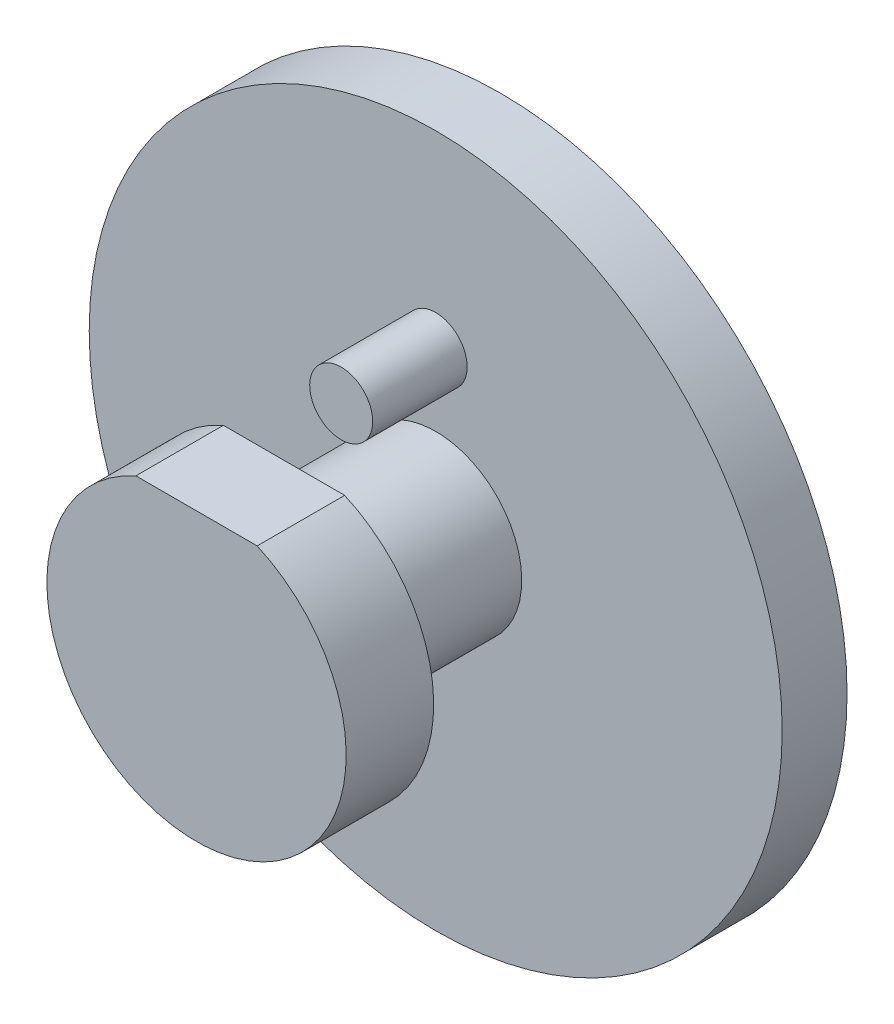
ISO-10303-21;
HEADER;
FILE_DESCRIPTION(('STEP AP214'),'2;1');
FILE_NAME('part.step','',(''),(''),'','','');
FILE_SCHEMA(('AUTOMOTIVE_DESIGN { 1 0 10303 214 1 1 1 1 }'));
ENDSEC;
DATA;
#1=APPLICATION_CONTEXT('core data for automotive mechanical design processes');
#2=APPLICATION_PROTOCOL_DEFINITION('international standard','automotive_design',2000,#1);
#3=PRODUCT_CONTEXT('',#1,'mechanical');
#4=PRODUCT('Part','Part','',(#3));
#5=PRODUCT_RELATED_PRODUCT_CATEGORY('part','',(#4));
#6=PRODUCT_DEFINITION_FORMATION('','',#4);
#7=PRODUCT_DEFINITION_CONTEXT('part definition',#1,'design');
#8=PRODUCT_DEFINITION('design','',#6,#7);
#9=PRODUCT_DEFINITION_SHAPE('','',#8);
#10=(LENGTH_UNIT() NAMED_UNIT(*) SI_UNIT(.MILLI.,.METRE.));
#11=(NAMED_UNIT(*) PLANE_ANGLE_UNIT() SI_UNIT($,.RADIAN.));
#12=(NAMED_UNIT(*) SI_UNIT($,.STERADIAN.) SOLID_ANGLE_UNIT());
#13=UNCERTAINTY_MEASURE_WITH_UNIT(LENGTH_MEASURE(1.E-05),#10,'distance_accuracy_value','');
#14=(GEOMETRIC_REPRESENTATION_CONTEXT(3) GLOBAL_UNCERTAINTY_ASSIGNED_CONTEXT((#13)) GLOBAL_UNIT_ASSIGNED_CONTEXT((#10,
#11,#12)) REPRESENTATION_CONTEXT('',''));
#15=CARTESIAN_POINT('',(0.,0.,0.));
#16=DIRECTION('',(0.,0.,1.));
#17=DIRECTION('',(1.,0.,0.));
#18=AXIS2_PLACEMENT_3D('',#15,#16,#17);
#19=CARTESIAN_POINT('',(39.944603412068,-18.266651036698,4.0692169679775));
#20=DIRECTION('',(0.,0.,1.));
#21=DIRECTION('',(1.,0.,0.));
#22=AXIS2_PLACEMENT_3D('',#19,#20,#21);
#23=PLANE('',#22);
#24=CARTESIAN_POINT('',(41.117637634,-17.094213762718,4.0692169679775));
#25=DIRECTION('',(0.,0.,1.));
#26=DIRECTION('',(1.,0.,0.));
#27=AXIS2_PLACEMENT_3D('',#24,#25,#26);
#28=CIRCLE('',#27,1.15912472548);
#29=CARTESIAN_POINT('',(40.6478001904893,-16.034580380058,4.0692169679775));
#30=VERTEX_POINT('',#29);
#31=CARTESIAN_POINT('',(41.5874750775107,-16.034580380058,4.0692169679775));
#32=VERTEX_POINT('',#31);
#33=EDGE_CURVE('E38',#30,#32,#28,.T.);
#34=ORIENTED_EDGE('',*,*,#33,.T.);
#35=DIRECTION('',(-1.,0.,0.));
#36=VECTOR('',#35,1.);
#37=CARTESIAN_POINT('',(41.117637634,-16.034580380058,4.0692169679775));
#38=LINE('',#37,#36);
#39=EDGE_CURVE('E62',#32,#30,#38,.T.);
#40=ORIENTED_EDGE('',*,*,#39,.T.);
#41=EDGE_LOOP('',(#34,#40));
#42=FACE_BOUND('',#41,.T.);
#43=ADVANCED_FACE('F34',(#42),#23,.T.);
#44=CARTESIAN_POINT('',(41.117637634,-17.094213762718,3.3914391903895));
#45=DIRECTION('',(0.,0.,1.));
#46=DIRECTION('',(1.,0.,0.));
#47=AXIS2_PLACEMENT_3D('',#44,#45,#46);
#48=CYLINDRICAL_SURFACE('',#47,1.15912472548);
#49=CARTESIAN_POINT('',(41.117637634,-17.094213762718,3.3914391903895));
#50=DIRECTION('',(0.,0.,1.));
#51=DIRECTION('',(1.,0.,0.));
#52=AXIS2_PLACEMENT_3D('',#49,#50,#51);
#53=CIRCLE('',#52,1.15912472548);
#54=CARTESIAN_POINT('',(41.5874750775107,-16.034580380058,3.3914391903895));
#55=VERTEX_POINT('',#54);
#56=CARTESIAN_POINT('',(40.6478001904893,-16.034580380058,3.3914391903895));
#57=VERTEX_POINT('',#56);
#58=EDGE_CURVE('E67',#55,#57,#53,.F.);
#59=ORIENTED_EDGE('',*,*,#58,.F.);
#60=DIRECTION('',(0.,0.,1.));
#61=VECTOR('',#60,1.);
#62=CARTESIAN_POINT('',(41.587475077248,-16.034580380058,3.7303280791835));
#63=LINE('',#62,#61);
#64=EDGE_CURVE('E64',#55,#32,#63,.T.);
#65=ORIENTED_EDGE('',*,*,#64,.T.);
#66=ORIENTED_EDGE('',*,*,#33,.F.);
#67=DIRECTION('',(0.,0.,-1.));
#68=VECTOR('',#67,1.);
#69=CARTESIAN_POINT('',(40.647800190752,-16.034580380058,3.7303280791835));
#70=LINE('',#69,#68);
#71=EDGE_CURVE('E53',#30,#57,#70,.T.);
#72=ORIENTED_EDGE('',*,*,#71,.T.);
#73=EDGE_LOOP('',(#59,#65,#66,#72));
#74=FACE_BOUND('',#73,.T.);
#75=ADVANCED_FACE('F65',(#74),#48,.T.);
#76=CARTESIAN_POINT('',(40.647800190752,-16.034580380058,4.0692169679775));
#77=DIRECTION('',(0.,-1.,0.));
#78=DIRECTION('',(0.,0.,-1.));
#79=AXIS2_PLACEMENT_3D('',#76,#77,#78);
#80=PLANE('',#79);
#81=ORIENTED_EDGE('',*,*,#64,.F.);
#82=DIRECTION('',(1.,0.,0.));
#83=VECTOR('',#82,1.);
#84=CARTESIAN_POINT('',(41.117637634122,-16.034580380058,3.3914391903895));
#85=LINE('',#84,#83);
#86=EDGE_CURVE('E73',#57,#55,#85,.T.);
#87=ORIENTED_EDGE('',*,*,#86,.F.);
#88=ORIENTED_EDGE('',*,*,#71,.F.);
#89=ORIENTED_EDGE('',*,*,#39,.F.);
#90=EDGE_LOOP('',(#81,#87,#88,#89));
#91=FACE_BOUND('',#90,.T.);
#92=ADVANCED_FACE('F71',(#91),#80,.F.);
#93=CARTESIAN_POINT('',(40.870709634,-16.121141762718,2.9485236491575));
#94=DIRECTION('',(0.,0.,1.));
#95=DIRECTION('',(1.,0.,0.));
#96=AXIS2_PLACEMENT_3D('',#93,#94,#95);
#97=PLANE('',#96);
#98=CARTESIAN_POINT('',(41.117637634,-15.874213762718,2.9485236491575));
#99=DIRECTION('',(0.,0.,1.));
#100=DIRECTION('',(0.,-1.,0.));
#101=AXIS2_PLACEMENT_3D('',#98,#99,#100);
#102=CIRCLE('',#101,0.244);
#103=CARTESIAN_POINT('',(41.117637634,-16.118213762718,2.9485236491575));
#104=VERTEX_POINT('',#103);
#105=EDGE_CURVE('E87',#104,#104,#102,.T.);
#106=ORIENTED_EDGE('',*,*,#105,.T.);
#107=EDGE_LOOP('',(#106));
#108=FACE_BOUND('',#107,.T.);
#109=ADVANCED_FACE('F96',(#108),#97,.T.);
#110=CARTESIAN_POINT('',(42.290671856176,-18.266651036698,3.3914391903895));
#111=DIRECTION('',(0.,0.,-1.));
#112=DIRECTION('',(-1.,0.,0.));
#113=AXIS2_PLACEMENT_3D('',#110,#111,#112);
#114=PLANE('',#113);
#115=CARTESIAN_POINT('',(41.117637634,-17.094213762718,3.3914391903895));
#116=DIRECTION('',(0.,0.,1.));
#117=DIRECTION('',(0.,-1.,0.));
#118=AXIS2_PLACEMENT_3D('',#115,#116,#117);
#119=CIRCLE('',#118,0.666522686131998);
#120=CARTESIAN_POINT('',(41.117637634,-17.76073644885,3.3914391903895));
#121=VERTEX_POINT('',#120);
#122=EDGE_CURVE('E84',#121,#121,#119,.T.);
#123=ORIENTED_EDGE('',*,*,#122,.T.);
#124=EDGE_LOOP('',(#123));
#125=FACE_BOUND('',#124,.T.);
#126=ORIENTED_EDGE('',*,*,#58,.T.);
#127=ORIENTED_EDGE('',*,*,#86,.T.);
#128=EDGE_LOOP('',(#126,#127));
#129=FACE_BOUND('',#128,.T.);
#130=ADVANCED_FACE('F93',(#125,#129),#114,.T.);
#131=CARTESIAN_POINT('',(41.117637634,-15.874213762718,2.2165236491575));
#132=DIRECTION('',(0.,0.,1.));
#133=DIRECTION('',(0.,-1.,0.));
#134=AXIS2_PLACEMENT_3D('',#131,#132,#133);
#135=CYLINDRICAL_SURFACE('',#134,0.244);
#136=ORIENTED_EDGE('',*,*,#105,.F.);
#137=EDGE_LOOP('',(#136));
#138=FACE_BOUND('',#137,.T.);
#139=CARTESIAN_POINT('',(41.117637634,-15.874213762718,2.2165236491575));
#140=DIRECTION('',(0.,0.,1.));
#141=DIRECTION('',(0.,-1.,0.));
#142=AXIS2_PLACEMENT_3D('',#139,#140,#141);
#143=CIRCLE('',#142,0.244);
#144=CARTESIAN_POINT('',(41.117637634,-16.118213762718,2.2165236491575));
#145=VERTEX_POINT('',#144);
#146=EDGE_CURVE('E81',#145,#145,#143,.F.);
#147=ORIENTED_EDGE('',*,*,#146,.F.);
#148=EDGE_LOOP('',(#147));
#149=FACE_BOUND('',#148,.T.);
#150=ADVANCED_FACE('F95',(#138,#149),#135,.T.);
#151=CARTESIAN_POINT('',(41.117637634,-17.094213762718,2.2165236491575));
#152=DIRECTION('',(0.,0.,1.));
#153=DIRECTION('',(0.,-1.,0.));
#154=AXIS2_PLACEMENT_3D('',#151,#152,#153);
#155=CYLINDRICAL_SURFACE('',#154,0.666522686131998);
#156=ORIENTED_EDGE('',*,*,#122,.F.);
#157=EDGE_LOOP('',(#156));
#158=FACE_BOUND('',#157,.T.);
#159=CARTESIAN_POINT('',(41.117637634,-17.094213762718,2.2165236491575));
#160=DIRECTION('',(0.,0.,1.));
#161=DIRECTION('',(0.,-1.,0.));
#162=AXIS2_PLACEMENT_3D('',#159,#160,#161);
#163=CIRCLE('',#162,0.666522686131998);
#164=CARTESIAN_POINT('',(41.117637634,-17.76073644885,2.2165236491575));
#165=VERTEX_POINT('',#164);
#166=EDGE_CURVE('E78',#165,#165,#163,.F.);
#167=ORIENTED_EDGE('',*,*,#166,.F.);
#168=EDGE_LOOP('',(#167));
#169=FACE_BOUND('',#168,.T.);
#170=ADVANCED_FACE('F103',(#158,#169),#155,.T.);
#171=CARTESIAN_POINT('',(38.401429634,-19.810421762718,2.2165236491575));
#172=DIRECTION('',(0.,0.,1.));
#173=DIRECTION('',(1.,0.,0.));
#174=AXIS2_PLACEMENT_3D('',#171,#172,#173);
#175=PLANE('',#174);
#176=ORIENTED_EDGE('',*,*,#166,.T.);
#177=EDGE_LOOP('',(#176));
#178=FACE_BOUND('',#177,.T.);
#179=ORIENTED_EDGE('',*,*,#146,.T.);
#180=EDGE_LOOP('',(#179));
#181=FACE_BOUND('',#180,.T.);
#182=CARTESIAN_POINT('',(41.117637634,-17.094213762718,2.2165236491575));
#183=DIRECTION('',(0.,0.,1.));
#184=DIRECTION('',(0.,-1.,0.));
#185=AXIS2_PLACEMENT_3D('',#182,#183,#184);
#186=CIRCLE('',#185,2.684);
#187=CARTESIAN_POINT('',(41.117637634,-19.778213762718,2.2165236491575));
#188=VERTEX_POINT('',#187);
#189=EDGE_CURVE('E44',#188,#188,#186,.T.);
#190=ORIENTED_EDGE('',*,*,#189,.T.);
#191=EDGE_LOOP('',(#190));
#192=FACE_BOUND('',#191,.T.);
#193=ADVANCED_FACE('F114',(#178,#181,#192),#175,.T.);
#194=CARTESIAN_POINT('',(43.833845634,-19.810421762718,1.7139391903895));
#195=DIRECTION('',(0.,0.,-1.));
#196=DIRECTION('',(-1.,0.,0.));
#197=AXIS2_PLACEMENT_3D('',#194,#195,#196);
#198=PLANE('',#197);
#199=CARTESIAN_POINT('',(41.117637634,-17.094213762718,1.7139391903895));
#200=DIRECTION('',(0.,0.,1.));
#201=DIRECTION('',(0.,-1.,0.));
#202=AXIS2_PLACEMENT_3D('',#199,#200,#201);
#203=CIRCLE('',#202,2.684);
#204=CARTESIAN_POINT('',(41.117637634,-19.778213762718,1.7139391903895));
#205=VERTEX_POINT('',#204);
#206=EDGE_CURVE('E11',#205,#205,#203,.F.);
#207=ORIENTED_EDGE('',*,*,#206,.T.);
#208=EDGE_LOOP('',(#207));
#209=FACE_BOUND('',#208,.T.);
#210=ADVANCED_FACE('F36',(#209),#198,.T.);
#211=CARTESIAN_POINT('',(41.117637634,-17.094213762718,1.7139391903895));
#212=DIRECTION('',(0.,0.,1.));
#213=DIRECTION('',(0.,-1.,0.));
#214=AXIS2_PLACEMENT_3D('',#211,#212,#213);
#215=CYLINDRICAL_SURFACE('',#214,2.684);
#216=ORIENTED_EDGE('',*,*,#189,.F.);
#217=EDGE_LOOP('',(#216));
#218=FACE_BOUND('',#217,.T.);
#219=ORIENTED_EDGE('',*,*,#206,.F.);
#220=EDGE_LOOP('',(#219));
#221=FACE_BOUND('',#220,.T.);
#222=ADVANCED_FACE('F107',(#218,#221),#215,.T.);
#223=CLOSED_SHELL('',(#43,#75,#92,#109,#130,#150,#170,#193,#210,#222));
#224=MANIFOLD_SOLID_BREP('B2',#223);
#225=ADVANCED_BREP_SHAPE_REPRESENTATION('',(#18,#224),#14);
#226=SHAPE_DEFINITION_REPRESENTATION(#9,#225);
ENDSEC;
END-ISO-10303-21;
